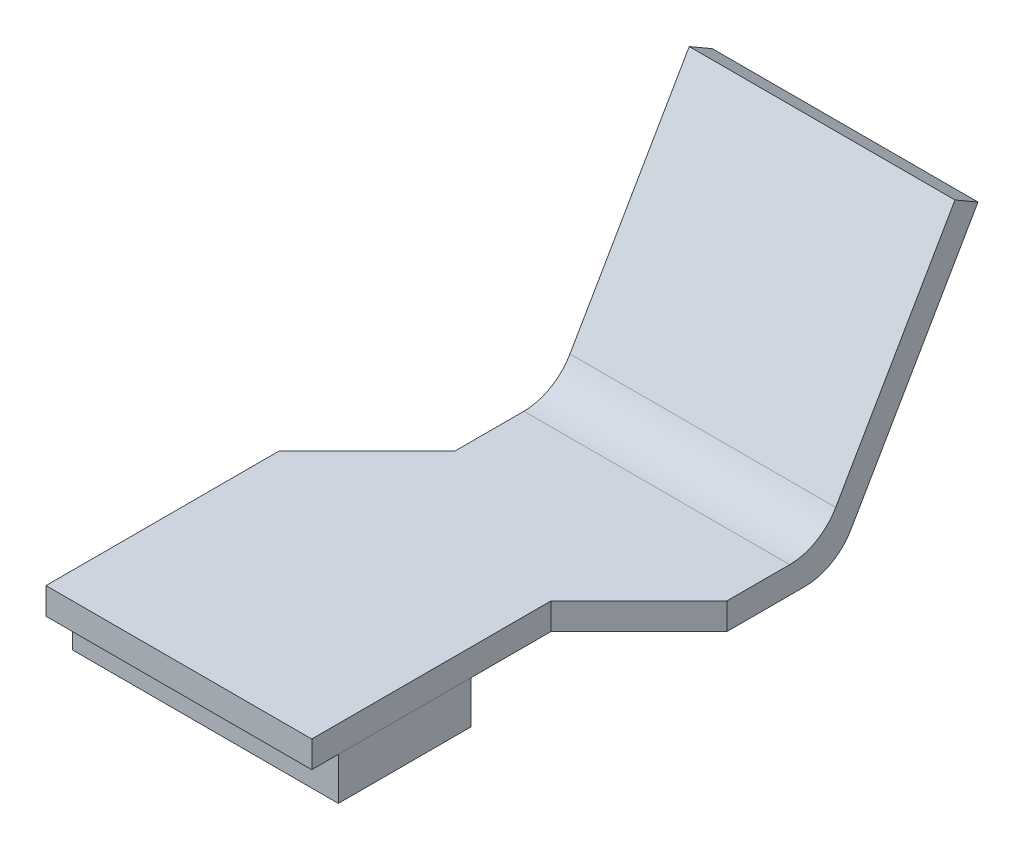
ISO-10303-21;
HEADER;
FILE_DESCRIPTION(('STEP AP214'),'2;1');
FILE_NAME('part.step','',(''),(''),'','','');
FILE_SCHEMA(('AUTOMOTIVE_DESIGN { 1 0 10303 214 1 1 1 1 }'));
ENDSEC;
DATA;
#1=APPLICATION_CONTEXT('core data for automotive mechanical design processes');
#2=APPLICATION_PROTOCOL_DEFINITION('international standard','automotive_design',2000,#1);
#3=PRODUCT_CONTEXT('',#1,'mechanical');
#4=PRODUCT('Part','Part','',(#3));
#5=PRODUCT_RELATED_PRODUCT_CATEGORY('part','',(#4));
#6=PRODUCT_DEFINITION_FORMATION('','',#4);
#7=PRODUCT_DEFINITION_CONTEXT('part definition',#1,'design');
#8=PRODUCT_DEFINITION('design','',#6,#7);
#9=PRODUCT_DEFINITION_SHAPE('','',#8);
#10=(LENGTH_UNIT() NAMED_UNIT(*) SI_UNIT(.MILLI.,.METRE.));
#11=(NAMED_UNIT(*) PLANE_ANGLE_UNIT() SI_UNIT($,.RADIAN.));
#12=(NAMED_UNIT(*) SI_UNIT($,.STERADIAN.) SOLID_ANGLE_UNIT());
#13=UNCERTAINTY_MEASURE_WITH_UNIT(LENGTH_MEASURE(1.E-05),#10,'distance_accuracy_value','');
#14=(GEOMETRIC_REPRESENTATION_CONTEXT(3) GLOBAL_UNCERTAINTY_ASSIGNED_CONTEXT((#13)) GLOBAL_UNIT_ASSIGNED_CONTEXT((#10,
#11,#12)) REPRESENTATION_CONTEXT('',''));
#15=CARTESIAN_POINT('',(0.,0.,0.));
#16=DIRECTION('',(0.,0.,1.));
#17=DIRECTION('',(1.,0.,0.));
#18=AXIS2_PLACEMENT_3D('',#15,#16,#17);
#19=CARTESIAN_POINT('',(0.,-1.6,15.4065524));
#20=DIRECTION('',(1.,0.,0.));
#21=DIRECTION('',(0.,0.,-1.));
#22=AXIS2_PLACEMENT_3D('',#19,#20,#21);
#23=PLANE('',#22);
#24=DIRECTION('',(0.,0.,-1.));
#25=VECTOR('',#24,1.);
#26=CARTESIAN_POINT('',(0.,0.,15.4065524));
#27=LINE('',#26,#25);
#28=CARTESIAN_POINT('',(0.,0.,15.4065524));
#29=VERTEX_POINT('',#28);
#30=CARTESIAN_POINT('',(0.,0.,10.4065524));
#31=VERTEX_POINT('',#30);
#32=EDGE_CURVE('E114',#29,#31,#27,.T.);
#33=ORIENTED_EDGE('',*,*,#32,.T.);
#34=DIRECTION('',(0.,1.,0.));
#35=VECTOR('',#34,1.);
#36=CARTESIAN_POINT('',(0.,-1.6,10.4065524));
#37=LINE('',#36,#35);
#38=CARTESIAN_POINT('',(0.,-1.6,10.4065524));
#39=VERTEX_POINT('',#38);
#40=EDGE_CURVE('E12',#39,#31,#37,.T.);
#41=ORIENTED_EDGE('',*,*,#40,.F.);
#42=DIRECTION('',(0.,0.,-1.));
#43=VECTOR('',#42,1.);
#44=CARTESIAN_POINT('',(0.,-1.6,15.4065524));
#45=LINE('',#44,#43);
#46=CARTESIAN_POINT('',(0.,-1.6,15.4065524));
#47=VERTEX_POINT('',#46);
#48=EDGE_CURVE('E102',#47,#39,#45,.T.);
#49=ORIENTED_EDGE('',*,*,#48,.F.);
#50=DIRECTION('',(0.,1.,0.));
#51=VECTOR('',#50,1.);
#52=CARTESIAN_POINT('',(0.,-1.6,15.4065524));
#53=LINE('',#52,#51);
#54=EDGE_CURVE('E110',#47,#29,#53,.T.);
#55=ORIENTED_EDGE('',*,*,#54,.T.);
#56=EDGE_LOOP('',(#33,#41,#49,#55));
#57=FACE_BOUND('',#56,.T.);
#58=ADVANCED_FACE('F51',(#57),#23,.F.);
#59=CARTESIAN_POINT('',(0.,-1.6,10.4065524));
#60=DIRECTION('',(0.,0.,1.));
#61=DIRECTION('',(1.,0.,0.));
#62=AXIS2_PLACEMENT_3D('',#59,#60,#61);
#63=PLANE('',#62);
#64=DIRECTION('',(1.,0.,0.));
#65=VECTOR('',#64,1.);
#66=CARTESIAN_POINT('',(0.,0.,10.4065524));
#67=LINE('',#66,#65);
#68=CARTESIAN_POINT('',(10.,0.,10.4065524));
#69=VERTEX_POINT('',#68);
#70=EDGE_CURVE('E106',#31,#69,#67,.T.);
#71=ORIENTED_EDGE('',*,*,#70,.T.);
#72=DIRECTION('',(0.,1.,0.));
#73=VECTOR('',#72,1.);
#74=CARTESIAN_POINT('',(10.,-1.6,10.4065524));
#75=LINE('',#74,#73);
#76=CARTESIAN_POINT('',(10.,-1.6,10.4065524));
#77=VERTEX_POINT('',#76);
#78=EDGE_CURVE('E59',#77,#69,#75,.T.);
#79=ORIENTED_EDGE('',*,*,#78,.F.);
#80=DIRECTION('',(1.,0.,0.));
#81=VECTOR('',#80,1.);
#82=CARTESIAN_POINT('',(0.,-1.6,10.4065524));
#83=LINE('',#82,#81);
#84=EDGE_CURVE('E97',#39,#77,#83,.T.);
#85=ORIENTED_EDGE('',*,*,#84,.F.);
#86=ORIENTED_EDGE('',*,*,#40,.T.);
#87=EDGE_LOOP('',(#71,#79,#85,#86));
#88=FACE_BOUND('',#87,.T.);
#89=ADVANCED_FACE('F105',(#88),#63,.F.);
#90=CARTESIAN_POINT('',(10.,-1.6,15.4065524));
#91=DIRECTION('',(-1.,0.,0.));
#92=DIRECTION('',(0.,0.,1.));
#93=AXIS2_PLACEMENT_3D('',#90,#91,#92);
#94=PLANE('',#93);
#95=DIRECTION('',(0.,0.,1.));
#96=VECTOR('',#95,1.);
#97=CARTESIAN_POINT('',(10.,0.,15.4065524));
#98=LINE('',#97,#96);
#99=CARTESIAN_POINT('',(10.,0.,15.4065524));
#100=VERTEX_POINT('',#99);
#101=EDGE_CURVE('E84',#69,#100,#98,.T.);
#102=ORIENTED_EDGE('',*,*,#101,.T.);
#103=DIRECTION('',(0.,1.,0.));
#104=VECTOR('',#103,1.);
#105=CARTESIAN_POINT('',(10.,-1.6,15.4065524));
#106=LINE('',#105,#104);
#107=CARTESIAN_POINT('',(10.,-1.6,15.4065524));
#108=VERTEX_POINT('',#107);
#109=EDGE_CURVE('E107',#108,#100,#106,.T.);
#110=ORIENTED_EDGE('',*,*,#109,.F.);
#111=DIRECTION('',(0.,0.,1.));
#112=VECTOR('',#111,1.);
#113=CARTESIAN_POINT('',(10.,-1.6,15.4065524));
#114=LINE('',#113,#112);
#115=EDGE_CURVE('E100',#77,#108,#114,.T.);
#116=ORIENTED_EDGE('',*,*,#115,.F.);
#117=ORIENTED_EDGE('',*,*,#78,.T.);
#118=EDGE_LOOP('',(#102,#110,#116,#117));
#119=FACE_BOUND('',#118,.T.);
#120=ADVANCED_FACE('F108',(#119),#94,.F.);
#121=CARTESIAN_POINT('',(0.,-1.6,15.4065524));
#122=DIRECTION('',(0.,0.,-1.));
#123=DIRECTION('',(-1.,0.,0.));
#124=AXIS2_PLACEMENT_3D('',#121,#122,#123);
#125=PLANE('',#124);
#126=DIRECTION('',(-1.,0.,0.));
#127=VECTOR('',#126,1.);
#128=CARTESIAN_POINT('',(0.,0.,15.4065524));
#129=LINE('',#128,#127);
#130=EDGE_CURVE('E90',#100,#29,#129,.T.);
#131=ORIENTED_EDGE('',*,*,#130,.T.);
#132=ORIENTED_EDGE('',*,*,#54,.F.);
#133=DIRECTION('',(-1.,0.,0.));
#134=VECTOR('',#133,1.);
#135=CARTESIAN_POINT('',(0.,-1.6,15.4065524));
#136=LINE('',#135,#134);
#137=EDGE_CURVE('E67',#108,#47,#136,.T.);
#138=ORIENTED_EDGE('',*,*,#137,.F.);
#139=ORIENTED_EDGE('',*,*,#109,.T.);
#140=EDGE_LOOP('',(#131,#132,#138,#139));
#141=FACE_BOUND('',#140,.T.);
#142=ADVANCED_FACE('F121',(#141),#125,.F.);
#143=CARTESIAN_POINT('',(0.,-1.6,0.));
#144=DIRECTION('',(0.,-1.,0.));
#145=DIRECTION('',(0.,0.,-1.));
#146=AXIS2_PLACEMENT_3D('',#143,#144,#145);
#147=PLANE('',#146);
#148=ORIENTED_EDGE('',*,*,#48,.T.);
#149=ORIENTED_EDGE('',*,*,#84,.T.);
#150=ORIENTED_EDGE('',*,*,#115,.T.);
#151=ORIENTED_EDGE('',*,*,#137,.T.);
#152=EDGE_LOOP('',(#148,#149,#150,#151));
#153=FACE_BOUND('',#152,.T.);
#154=ADVANCED_FACE('F98',(#153),#147,.T.);
#155=CARTESIAN_POINT('',(0.,0.,0.));
#156=DIRECTION('',(0.,-1.,0.));
#157=DIRECTION('',(0.,0.,-1.));
#158=AXIS2_PLACEMENT_3D('',#155,#156,#157);
#159=PLANE('',#158);
#160=ORIENTED_EDGE('',*,*,#32,.F.);
#161=ORIENTED_EDGE('',*,*,#130,.F.);
#162=ORIENTED_EDGE('',*,*,#101,.F.);
#163=ORIENTED_EDGE('',*,*,#70,.F.);
#164=EDGE_LOOP('',(#160,#161,#162,#163));
#165=FACE_BOUND('',#164,.T.);
#166=ADVANCED_FACE('F124',(#165),#159,.F.);
#167=CLOSED_SHELL('',(#58,#89,#120,#142,#154,#166));
#168=MANIFOLD_SOLID_BREP('B2',#167);
#169=CARTESIAN_POINT('',(13.31,0.999999999999998,0.57735026918963));
#170=DIRECTION('',(0.,-1.,0.));
#171=DIRECTION('',(0.,0.,-1.));
#172=AXIS2_PLACEMENT_3D('',#169,#170,#171);
#173=PLANE('',#172);
#174=DIRECTION('',(-1.,0.,0.));
#175=VECTOR('',#174,1.);
#176=CARTESIAN_POINT('',(0.,0.999999999999997,1.73205080756889));
#177=LINE('',#176,#175);
#178=CARTESIAN_POINT('',(13.31,0.999999999999997,1.73205080756889));
#179=VERTEX_POINT('',#178);
#180=CARTESIAN_POINT('',(3.31,0.999999999999997,1.73205080756889));
#181=VERTEX_POINT('',#180);
#182=EDGE_CURVE('E319',#179,#181,#177,.T.);
#183=ORIENTED_EDGE('',*,*,#182,.T.);
#184=DIRECTION('',(0.,0.,1.));
#185=VECTOR('',#184,1.);
#186=CARTESIAN_POINT('',(3.31,0.999999999999998,0.57735026918963));
#187=LINE('',#186,#185);
#188=CARTESIAN_POINT('',(3.31,0.999999999999997,4.33604999999999));
#189=VERTEX_POINT('',#188);
#190=EDGE_CURVE('E276',#181,#189,#187,.T.);
#191=ORIENTED_EDGE('',*,*,#190,.T.);
#192=DIRECTION('',(-0.707106781186543,0.,0.707106781186552));
#193=VECTOR('',#192,1.);
#194=CARTESIAN_POINT('',(10.1893498654051,0.999999999999998,-2.54329986540521));
#195=LINE('',#194,#193);
#196=CARTESIAN_POINT('',(0.,0.999999999999996,7.64605000000003));
#197=VERTEX_POINT('',#196);
#198=EDGE_CURVE('E275',#189,#197,#195,.T.);
#199=ORIENTED_EDGE('',*,*,#198,.T.);
#200=DIRECTION('',(0.,0.,1.));
#201=VECTOR('',#200,1.);
#202=CARTESIAN_POINT('',(0.,0.999999999999998,0.57735026918963));
#203=LINE('',#202,#201);
#204=CARTESIAN_POINT('',(0.,0.999999999999996,16.4065524));
#205=VERTEX_POINT('',#204);
#206=EDGE_CURVE('E284',#197,#205,#203,.T.);
#207=ORIENTED_EDGE('',*,*,#206,.T.);
#208=DIRECTION('',(-1.,0.,0.));
#209=VECTOR('',#208,1.);
#210=CARTESIAN_POINT('',(13.31,0.999999999999996,16.4065524));
#211=LINE('',#210,#209);
#212=CARTESIAN_POINT('',(10.,0.999999999999996,16.4065524));
#213=VERTEX_POINT('',#212);
#214=EDGE_CURVE('E311',#213,#205,#211,.T.);
#215=ORIENTED_EDGE('',*,*,#214,.F.);
#216=DIRECTION('',(0.,0.,-1.));
#217=VECTOR('',#216,1.);
#218=CARTESIAN_POINT('',(10.,0.999999999999996,16.4065524));
#219=LINE('',#218,#217);
#220=CARTESIAN_POINT('',(10.,0.999999999999997,7.4065524));
#221=VERTEX_POINT('',#220);
#222=EDGE_CURVE('E371',#213,#221,#219,.T.);
#223=ORIENTED_EDGE('',*,*,#222,.T.);
#224=DIRECTION('',(0.707106781186544,0.,-0.707106781186552));
#225=VECTOR('',#224,1.);
#226=CARTESIAN_POINT('',(10.,0.999999999999997,7.4065524));
#227=LINE('',#226,#225);
#228=CARTESIAN_POINT('',(13.31,0.999999999999998,4.09655239999997));
#229=VERTEX_POINT('',#228);
#230=EDGE_CURVE('E350',#221,#229,#227,.T.);
#231=ORIENTED_EDGE('',*,*,#230,.T.);
#232=DIRECTION('',(0.,0.,1.));
#233=VECTOR('',#232,1.);
#234=CARTESIAN_POINT('',(13.31,0.999999999999998,0.57735026918963));
#235=LINE('',#234,#233);
#236=EDGE_CURVE('E341',#179,#229,#235,.T.);
#237=ORIENTED_EDGE('',*,*,#236,.F.);
#238=EDGE_LOOP('',(#183,#191,#199,#207,#215,#223,#231,#237));
#239=FACE_BOUND('',#238,.T.);
#240=ADVANCED_FACE('F175',(#239),#173,.F.);
#241=CARTESIAN_POINT('',(13.31,0.,16.4065524));
#242=DIRECTION('',(0.,0.,-1.));
#243=DIRECTION('',(-1.,0.,0.));
#244=AXIS2_PLACEMENT_3D('',#241,#242,#243);
#245=PLANE('',#244);
#246=DIRECTION('',(0.,-1.,0.));
#247=VECTOR('',#246,1.);
#248=CARTESIAN_POINT('',(10.,13.7472428391398,16.4065524));
#249=LINE('',#248,#247);
#250=CARTESIAN_POINT('',(10.,0.,16.4065524));
#251=VERTEX_POINT('',#250);
#252=EDGE_CURVE('E383',#213,#251,#249,.T.);
#253=ORIENTED_EDGE('',*,*,#252,.F.);
#254=ORIENTED_EDGE('',*,*,#214,.T.);
#255=DIRECTION('',(0.,-1.,0.));
#256=VECTOR('',#255,1.);
#257=CARTESIAN_POINT('',(0.,0.,16.4065524));
#258=LINE('',#257,#256);
#259=CARTESIAN_POINT('',(0.,0.,16.4065524));
#260=VERTEX_POINT('',#259);
#261=EDGE_CURVE('E294',#205,#260,#258,.T.);
#262=ORIENTED_EDGE('',*,*,#261,.T.);
#263=DIRECTION('',(-1.,0.,0.));
#264=VECTOR('',#263,1.);
#265=CARTESIAN_POINT('',(13.31,0.,16.4065524));
#266=LINE('',#265,#264);
#267=EDGE_CURVE('E290',#251,#260,#266,.T.);
#268=ORIENTED_EDGE('',*,*,#267,.F.);
#269=EDGE_LOOP('',(#253,#254,#262,#268));
#270=FACE_BOUND('',#269,.T.);
#271=ADVANCED_FACE('F400',(#270),#245,.F.);
#272=CARTESIAN_POINT('',(13.31,0.,16.4065524));
#273=DIRECTION('',(0.,1.,0.));
#274=DIRECTION('',(0.,0.,1.));
#275=AXIS2_PLACEMENT_3D('',#272,#273,#274);
#276=PLANE('',#275);
#277=DIRECTION('',(0.707106781186543,0.,-0.707106781186552));
#278=VECTOR('',#277,1.);
#279=CARTESIAN_POINT('',(2.27474879999993,0.,5.37130120000007));
#280=LINE('',#279,#278);
#281=CARTESIAN_POINT('',(0.,0.,7.64605000000003));
#282=VERTEX_POINT('',#281);
#283=CARTESIAN_POINT('',(3.31,0.,4.33604999999999));
#284=VERTEX_POINT('',#283);
#285=EDGE_CURVE('E266',#282,#284,#280,.T.);
#286=ORIENTED_EDGE('',*,*,#285,.T.);
#287=DIRECTION('',(0.,0.,-1.));
#288=VECTOR('',#287,1.);
#289=CARTESIAN_POINT('',(3.31,0.,16.4065524));
#290=LINE('',#289,#288);
#291=CARTESIAN_POINT('',(3.31,0.,1.15470053837926));
#292=VERTEX_POINT('',#291);
#293=EDGE_CURVE('E364',#284,#292,#290,.T.);
#294=ORIENTED_EDGE('',*,*,#293,.T.);
#295=DIRECTION('',(-1.,0.,0.));
#296=VECTOR('',#295,1.);
#297=CARTESIAN_POINT('',(13.31,0.,1.15470053837926));
#298=LINE('',#297,#296);
#299=CARTESIAN_POINT('',(13.31,0.,1.15470053837926));
#300=VERTEX_POINT('',#299);
#301=EDGE_CURVE('E198',#292,#300,#298,.F.);
#302=ORIENTED_EDGE('',*,*,#301,.T.);
#303=DIRECTION('',(0.,0.,-1.));
#304=VECTOR('',#303,1.);
#305=CARTESIAN_POINT('',(13.31,0.,16.4065524));
#306=LINE('',#305,#304);
#307=CARTESIAN_POINT('',(13.31,0.,4.09655239999997));
#308=VERTEX_POINT('',#307);
#309=EDGE_CURVE('E352',#308,#300,#306,.T.);
#310=ORIENTED_EDGE('',*,*,#309,.F.);
#311=DIRECTION('',(-0.707106781186543,0.,0.707106781186552));
#312=VECTOR('',#311,1.);
#313=CARTESIAN_POINT('',(10.,0.,7.4065524));
#314=LINE('',#313,#312);
#315=CARTESIAN_POINT('',(10.,0.,7.4065524));
#316=VERTEX_POINT('',#315);
#317=EDGE_CURVE('E370',#308,#316,#314,.T.);
#318=ORIENTED_EDGE('',*,*,#317,.T.);
#319=DIRECTION('',(0.,0.,1.));
#320=VECTOR('',#319,1.);
#321=CARTESIAN_POINT('',(10.,0.,16.4065524));
#322=LINE('',#321,#320);
#323=EDGE_CURVE('E380',#316,#251,#322,.T.);
#324=ORIENTED_EDGE('',*,*,#323,.T.);
#325=ORIENTED_EDGE('',*,*,#267,.T.);
#326=DIRECTION('',(0.,0.,-1.));
#327=VECTOR('',#326,1.);
#328=CARTESIAN_POINT('',(0.,0.,16.4065524));
#329=LINE('',#328,#327);
#330=EDGE_CURVE('E283',#260,#282,#329,.T.);
#331=ORIENTED_EDGE('',*,*,#330,.T.);
#332=EDGE_LOOP('',(#286,#294,#302,#310,#318,#324,#325,#331));
#333=FACE_BOUND('',#332,.T.);
#334=ADVANCED_FACE('F287',(#333),#276,.F.);
#335=CARTESIAN_POINT('',(13.31,0.,0.));
#336=DIRECTION('',(1.,0.,0.));
#337=DIRECTION('',(0.,0.,-1.));
#338=AXIS2_PLACEMENT_3D('',#335,#336,#337);
#339=PLANE('',#338);
#340=ORIENTED_EDGE('',*,*,#309,.T.);
#341=CARTESIAN_POINT('',(13.31,2.,1.15470053837926));
#342=DIRECTION('',(1.,0.,0.));
#343=DIRECTION('',(0.,0.,-1.));
#344=AXIS2_PLACEMENT_3D('',#341,#342,#343);
#345=CIRCLE('',#344,2.);
#346=CARTESIAN_POINT('',(13.31,1.00000000000001,-0.577350269189625));
#347=VERTEX_POINT('',#346);
#348=EDGE_CURVE('E332',#300,#347,#345,.T.);
#349=ORIENTED_EDGE('',*,*,#348,.T.);
#350=DIRECTION('',(0.,0.86602540378444,-0.499999999999997));
#351=VECTOR('',#350,1.);
#352=CARTESIAN_POINT('',(13.31,0.,0.));
#353=LINE('',#352,#351);
#354=CARTESIAN_POINT('',(13.31,9.27331342118341,-5.35394999999997));
#355=VERTEX_POINT('',#354);
#356=EDGE_CURVE('E308',#347,#355,#353,.T.);
#357=ORIENTED_EDGE('',*,*,#356,.T.);
#358=DIRECTION('',(0.,0.499999999999998,0.86602540378444));
#359=VECTOR('',#358,1.);
#360=CARTESIAN_POINT('',(13.31,9.27331342118341,-5.35394999999997));
#361=LINE('',#360,#359);
#362=CARTESIAN_POINT('',(13.31,9.77331342118341,-4.48792459621553));
#363=VERTEX_POINT('',#362);
#364=EDGE_CURVE('E293',#355,#363,#361,.T.);
#365=ORIENTED_EDGE('',*,*,#364,.T.);
#366=DIRECTION('',(0.,-0.86602540378444,0.499999999999997));
#367=VECTOR('',#366,1.);
#368=CARTESIAN_POINT('',(13.31,9.77331342118341,-4.48792459621553));
#369=LINE('',#368,#367);
#370=CARTESIAN_POINT('',(13.31,2.00000000000001,0.));
#371=VERTEX_POINT('',#370);
#372=EDGE_CURVE('E299',#363,#371,#369,.T.);
#373=ORIENTED_EDGE('',*,*,#372,.T.);
#374=CARTESIAN_POINT('',(13.31,3.,1.73205080756889));
#375=DIRECTION('',(1.,0.,0.));
#376=DIRECTION('',(0.,0.,-1.));
#377=AXIS2_PLACEMENT_3D('',#374,#375,#376);
#378=CIRCLE('',#377,2.);
#379=EDGE_CURVE('E184',#371,#179,#378,.F.);
#380=ORIENTED_EDGE('',*,*,#379,.T.);
#381=ORIENTED_EDGE('',*,*,#236,.T.);
#382=DIRECTION('',(0.,-1.,0.));
#383=VECTOR('',#382,1.);
#384=CARTESIAN_POINT('',(13.31,13.7472428391398,4.09655239999997));
#385=LINE('',#384,#383);
#386=EDGE_CURVE('E374',#229,#308,#385,.T.);
#387=ORIENTED_EDGE('',*,*,#386,.T.);
#388=EDGE_LOOP('',(#340,#349,#357,#365,#373,#380,#381,#387));
#389=FACE_BOUND('',#388,.T.);
#390=ADVANCED_FACE('F339',(#389),#339,.T.);
#391=CARTESIAN_POINT('',(13.31,9.27331342118341,-5.35394999999997));
#392=DIRECTION('',(0.,-0.86602540378444,0.499999999999998));
#393=DIRECTION('',(0.,-0.499999999999998,-0.86602540378444));
#394=AXIS2_PLACEMENT_3D('',#391,#392,#393);
#395=PLANE('',#394);
#396=DIRECTION('',(-1.,0.,0.));
#397=VECTOR('',#396,1.);
#398=CARTESIAN_POINT('',(13.31,9.27331342118341,-5.35394999999997));
#399=LINE('',#398,#397);
#400=CARTESIAN_POINT('',(3.31,9.27331342118341,-5.35394999999997));
#401=VERTEX_POINT('',#400);
#402=EDGE_CURVE('E304',#355,#401,#399,.T.);
#403=ORIENTED_EDGE('',*,*,#402,.T.);
#404=DIRECTION('',(0.,0.499999999999998,0.86602540378444));
#405=VECTOR('',#404,1.);
#406=CARTESIAN_POINT('',(3.31,9.27331342118341,-5.35394999999997));
#407=LINE('',#406,#405);
#408=CARTESIAN_POINT('',(3.31,9.77331342118341,-4.48792459621553));
#409=VERTEX_POINT('',#408);
#410=EDGE_CURVE('E419',#401,#409,#407,.T.);
#411=ORIENTED_EDGE('',*,*,#410,.T.);
#412=DIRECTION('',(-1.,0.,0.));
#413=VECTOR('',#412,1.);
#414=CARTESIAN_POINT('',(13.31,9.77331342118341,-4.48792459621553));
#415=LINE('',#414,#413);
#416=EDGE_CURVE('E315',#363,#409,#415,.T.);
#417=ORIENTED_EDGE('',*,*,#416,.F.);
#418=ORIENTED_EDGE('',*,*,#364,.F.);
#419=EDGE_LOOP('',(#403,#411,#417,#418));
#420=FACE_BOUND('',#419,.T.);
#421=ADVANCED_FACE('F418',(#420),#395,.F.);
#422=CARTESIAN_POINT('',(13.31,9.77331342118341,-4.48792459621553));
#423=DIRECTION('',(0.,-0.499999999999997,-0.86602540378444));
#424=DIRECTION('',(0.,0.86602540378444,-0.499999999999997));
#425=AXIS2_PLACEMENT_3D('',#422,#423,#424);
#426=PLANE('',#425);
#427=ORIENTED_EDGE('',*,*,#416,.T.);
#428=DIRECTION('',(0.,-0.86602540378444,0.499999999999997));
#429=VECTOR('',#428,1.);
#430=CARTESIAN_POINT('',(3.31,9.77331342118341,-4.48792459621553));
#431=LINE('',#430,#429);
#432=CARTESIAN_POINT('',(3.31,2.00000000000001,0.));
#433=VERTEX_POINT('',#432);
#434=EDGE_CURVE('E359',#409,#433,#431,.T.);
#435=ORIENTED_EDGE('',*,*,#434,.T.);
#436=DIRECTION('',(-1.,0.,0.));
#437=VECTOR('',#436,1.);
#438=CARTESIAN_POINT('',(13.31,2.,0.));
#439=LINE('',#438,#437);
#440=EDGE_CURVE('E323',#433,#371,#439,.F.);
#441=ORIENTED_EDGE('',*,*,#440,.T.);
#442=ORIENTED_EDGE('',*,*,#372,.F.);
#443=EDGE_LOOP('',(#427,#435,#441,#442));
#444=FACE_BOUND('',#443,.T.);
#445=ADVANCED_FACE('F421',(#444),#426,.F.);
#446=CARTESIAN_POINT('',(13.31,0.,0.));
#447=DIRECTION('',(0.,0.499999999999997,0.86602540378444));
#448=DIRECTION('',(0.,-0.86602540378444,0.499999999999997));
#449=AXIS2_PLACEMENT_3D('',#446,#447,#448);
#450=PLANE('',#449);
#451=DIRECTION('',(-1.,0.,0.));
#452=VECTOR('',#451,1.);
#453=CARTESIAN_POINT('',(13.31,1.00000000000001,-0.577350269189625));
#454=LINE('',#453,#452);
#455=CARTESIAN_POINT('',(3.31,1.00000000000001,-0.577350269189625));
#456=VERTEX_POINT('',#455);
#457=EDGE_CURVE('E326',#347,#456,#454,.T.);
#458=ORIENTED_EDGE('',*,*,#457,.T.);
#459=DIRECTION('',(0.,0.86602540378444,-0.499999999999997));
#460=VECTOR('',#459,1.);
#461=CARTESIAN_POINT('',(3.31,0.,0.));
#462=LINE('',#461,#460);
#463=EDGE_CURVE('E190',#456,#401,#462,.T.);
#464=ORIENTED_EDGE('',*,*,#463,.T.);
#465=ORIENTED_EDGE('',*,*,#402,.F.);
#466=ORIENTED_EDGE('',*,*,#356,.F.);
#467=EDGE_LOOP('',(#458,#464,#465,#466));
#468=FACE_BOUND('',#467,.T.);
#469=ADVANCED_FACE('F412',(#468),#450,.F.);
#470=CARTESIAN_POINT('',(0.,0.,0.));
#471=DIRECTION('',(1.,0.,0.));
#472=DIRECTION('',(0.,0.,-1.));
#473=AXIS2_PLACEMENT_3D('',#470,#471,#472);
#474=PLANE('',#473);
#475=ORIENTED_EDGE('',*,*,#206,.F.);
#476=DIRECTION('',(0.,1.,0.));
#477=VECTOR('',#476,1.);
#478=CARTESIAN_POINT('',(0.,-1.6,7.64605000000003));
#479=LINE('',#478,#477);
#480=EDGE_CURVE('E269',#282,#197,#479,.T.);
#481=ORIENTED_EDGE('',*,*,#480,.F.);
#482=ORIENTED_EDGE('',*,*,#330,.F.);
#483=ORIENTED_EDGE('',*,*,#261,.F.);
#484=EDGE_LOOP('',(#475,#481,#482,#483));
#485=FACE_BOUND('',#484,.T.);
#486=ADVANCED_FACE('F281',(#485),#474,.F.);
#487=CARTESIAN_POINT('',(10.,13.7472428391398,16.4065524));
#488=DIRECTION('',(1.,0.,0.));
#489=DIRECTION('',(0.,0.,-1.));
#490=AXIS2_PLACEMENT_3D('',#487,#488,#489);
#491=PLANE('',#490);
#492=ORIENTED_EDGE('',*,*,#252,.T.);
#493=ORIENTED_EDGE('',*,*,#323,.F.);
#494=DIRECTION('',(0.,-1.,0.));
#495=VECTOR('',#494,1.);
#496=CARTESIAN_POINT('',(10.,13.7472428391398,7.4065524));
#497=LINE('',#496,#495);
#498=EDGE_CURVE('E386',#221,#316,#497,.T.);
#499=ORIENTED_EDGE('',*,*,#498,.F.);
#500=ORIENTED_EDGE('',*,*,#222,.F.);
#501=EDGE_LOOP('',(#492,#493,#499,#500));
#502=FACE_BOUND('',#501,.T.);
#503=ADVANCED_FACE('F403',(#502),#491,.T.);
#504=CARTESIAN_POINT('',(10.,13.7472428391398,7.4065524));
#505=DIRECTION('',(0.707106781186552,0.,0.707106781186544));
#506=DIRECTION('',(0.707106781186544,0.,-0.707106781186552));
#507=AXIS2_PLACEMENT_3D('',#504,#505,#506);
#508=PLANE('',#507);
#509=ORIENTED_EDGE('',*,*,#498,.T.);
#510=ORIENTED_EDGE('',*,*,#317,.F.);
#511=ORIENTED_EDGE('',*,*,#386,.F.);
#512=ORIENTED_EDGE('',*,*,#230,.F.);
#513=EDGE_LOOP('',(#509,#510,#511,#512));
#514=FACE_BOUND('',#513,.T.);
#515=ADVANCED_FACE('F406',(#514),#508,.T.);
#516=CARTESIAN_POINT('',(13.31,3.,1.73205080756889));
#517=DIRECTION('',(1.,0.,0.));
#518=DIRECTION('',(0.,0.,-1.));
#519=AXIS2_PLACEMENT_3D('',#516,#517,#518);
#520=CYLINDRICAL_SURFACE('',#519,2.);
#521=ORIENTED_EDGE('',*,*,#440,.F.);
#522=CARTESIAN_POINT('',(3.31,3.,1.73205080756889));
#523=DIRECTION('',(1.,0.,0.));
#524=DIRECTION('',(0.,0.,-1.));
#525=AXIS2_PLACEMENT_3D('',#522,#523,#524);
#526=CIRCLE('',#525,2.);
#527=EDGE_CURVE('E356',#433,#181,#526,.F.);
#528=ORIENTED_EDGE('',*,*,#527,.T.);
#529=ORIENTED_EDGE('',*,*,#182,.F.);
#530=ORIENTED_EDGE('',*,*,#379,.F.);
#531=EDGE_LOOP('',(#521,#528,#529,#530));
#532=FACE_BOUND('',#531,.T.);
#533=ADVANCED_FACE('F355',(#532),#520,.F.);
#534=CARTESIAN_POINT('',(13.31,2.,1.15470053837926));
#535=DIRECTION('',(-1.,0.,0.));
#536=DIRECTION('',(0.,0.,1.));
#537=AXIS2_PLACEMENT_3D('',#534,#535,#536);
#538=CYLINDRICAL_SURFACE('',#537,2.);
#539=CARTESIAN_POINT('',(3.31,2.,1.15470053837926));
#540=DIRECTION('',(1.,0.,0.));
#541=DIRECTION('',(0.,0.,-1.));
#542=AXIS2_PLACEMENT_3D('',#539,#540,#541);
#543=CIRCLE('',#542,2.);
#544=EDGE_CURVE('E49',#456,#292,#543,.F.);
#545=ORIENTED_EDGE('',*,*,#544,.F.);
#546=ORIENTED_EDGE('',*,*,#457,.F.);
#547=ORIENTED_EDGE('',*,*,#348,.F.);
#548=ORIENTED_EDGE('',*,*,#301,.F.);
#549=EDGE_LOOP('',(#545,#546,#547,#548));
#550=FACE_BOUND('',#549,.T.);
#551=ADVANCED_FACE('F177',(#550),#538,.T.);
#552=CARTESIAN_POINT('',(0.,-1.6,7.64605000000003));
#553=DIRECTION('',(0.707106781186552,0.,0.707106781186543));
#554=DIRECTION('',(0.707106781186543,0.,-0.707106781186552));
#555=AXIS2_PLACEMENT_3D('',#552,#553,#554);
#556=PLANE('',#555);
#557=DIRECTION('',(0.,1.,0.));
#558=VECTOR('',#557,1.);
#559=CARTESIAN_POINT('',(3.31,-1.6,4.33604999999999));
#560=LINE('',#559,#558);
#561=EDGE_CURVE('E272',#284,#189,#560,.T.);
#562=ORIENTED_EDGE('',*,*,#561,.F.);
#563=ORIENTED_EDGE('',*,*,#285,.F.);
#564=ORIENTED_EDGE('',*,*,#480,.T.);
#565=ORIENTED_EDGE('',*,*,#198,.F.);
#566=EDGE_LOOP('',(#562,#563,#564,#565));
#567=FACE_BOUND('',#566,.T.);
#568=ADVANCED_FACE('F268',(#567),#556,.F.);
#569=CARTESIAN_POINT('',(3.31,-1.6,4.33604999999999));
#570=DIRECTION('',(1.,0.,0.));
#571=DIRECTION('',(0.,0.,-1.));
#572=AXIS2_PLACEMENT_3D('',#569,#570,#571);
#573=PLANE('',#572);
#574=ORIENTED_EDGE('',*,*,#527,.F.);
#575=ORIENTED_EDGE('',*,*,#434,.F.);
#576=ORIENTED_EDGE('',*,*,#410,.F.);
#577=ORIENTED_EDGE('',*,*,#463,.F.);
#578=ORIENTED_EDGE('',*,*,#544,.T.);
#579=ORIENTED_EDGE('',*,*,#293,.F.);
#580=ORIENTED_EDGE('',*,*,#561,.T.);
#581=ORIENTED_EDGE('',*,*,#190,.F.);
#582=EDGE_LOOP('',(#574,#575,#576,#577,#578,#579,#580,#581));
#583=FACE_BOUND('',#582,.T.);
#584=ADVANCED_FACE('F422',(#583),#573,.F.);
#585=CLOSED_SHELL('',(#240,#271,#334,#390,#421,#445,#469,#486,#503,#515,#533,#551,#568,#584));
#586=MANIFOLD_SOLID_BREP('B6',#585);
#587=ADVANCED_BREP_SHAPE_REPRESENTATION('',(#18,#168,#586),#14);
#588=SHAPE_DEFINITION_REPRESENTATION(#9,#587);
ENDSEC;
END-ISO-10303-21;
